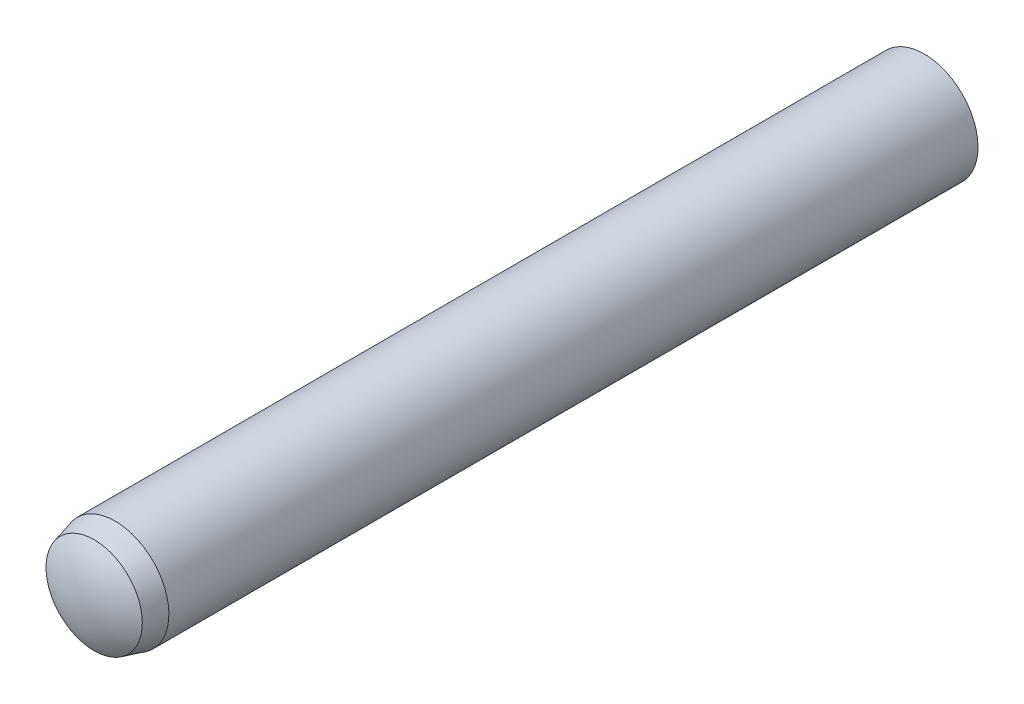
ISO-10303-21;
HEADER;
FILE_DESCRIPTION(('STEP AP214'),'2;1');
FILE_NAME('part.step','',(''),(''),'','','');
FILE_SCHEMA(('AUTOMOTIVE_DESIGN { 1 0 10303 214 1 1 1 1 }'));
ENDSEC;
DATA;
#1=APPLICATION_CONTEXT('core data for automotive mechanical design processes');
#2=APPLICATION_PROTOCOL_DEFINITION('international standard','automotive_design',2000,#1);
#3=PRODUCT_CONTEXT('',#1,'mechanical');
#4=PRODUCT('Part','Part','',(#3));
#5=PRODUCT_RELATED_PRODUCT_CATEGORY('part','',(#4));
#6=PRODUCT_DEFINITION_FORMATION('','',#4);
#7=PRODUCT_DEFINITION_CONTEXT('part definition',#1,'design');
#8=PRODUCT_DEFINITION('design','',#6,#7);
#9=PRODUCT_DEFINITION_SHAPE('','',#8);
#10=(LENGTH_UNIT() NAMED_UNIT(*) SI_UNIT(.MILLI.,.METRE.));
#11=(NAMED_UNIT(*) PLANE_ANGLE_UNIT() SI_UNIT($,.RADIAN.));
#12=(NAMED_UNIT(*) SI_UNIT($,.STERADIAN.) SOLID_ANGLE_UNIT());
#13=UNCERTAINTY_MEASURE_WITH_UNIT(LENGTH_MEASURE(1.E-05),#10,'distance_accuracy_value','');
#14=(GEOMETRIC_REPRESENTATION_CONTEXT(3) GLOBAL_UNCERTAINTY_ASSIGNED_CONTEXT((#13)) GLOBAL_UNIT_ASSIGNED_CONTEXT((#10,
#11,#12)) REPRESENTATION_CONTEXT('',''));
#15=CARTESIAN_POINT('',(0.,0.,0.));
#16=DIRECTION('',(0.,0.,1.));
#17=DIRECTION('',(1.,0.,0.));
#18=AXIS2_PLACEMENT_3D('',#15,#16,#17);
#19=CARTESIAN_POINT('',(0.,0.,-30.9166666666668));
#20=DIRECTION('',(0.,0.,1.));
#21=DIRECTION('',(0.,-1.,0.));
#22=AXIS2_PLACEMENT_3D('',#19,#20,#21);
#23=SPHERICAL_SURFACE('',#22,9.08333333333317);
#24=CARTESIAN_POINT('',(0.,0.,-38.5));
#25=DIRECTION('',(0.,0.,1.));
#26=DIRECTION('',(0.,-1.,0.));
#27=AXIS2_PLACEMENT_3D('',#24,#25,#26);
#28=CIRCLE('',#27,4.99999999999999);
#29=CARTESIAN_POINT('',(0.,-4.99999999999998,-38.5));
#30=VERTEX_POINT('',#29);
#31=EDGE_CURVE('E10',#30,#30,#28,.T.);
#32=ORIENTED_EDGE('',*,*,#31,.F.);
#33=EDGE_LOOP('',(#32));
#34=FACE_BOUND('',#33,.T.);
#35=ADVANCED_FACE('F32',(#34),#23,.T.);
#36=CARTESIAN_POINT('',(0.,0.,40.));
#37=DIRECTION('',(0.,0.,1.));
#38=DIRECTION('',(0.,-1.,0.));
#39=AXIS2_PLACEMENT_3D('',#36,#37,#38);
#40=CYLINDRICAL_SURFACE('',#39,5.);
#41=CARTESIAN_POINT('',(0.,0.,36.75));
#42=DIRECTION('',(0.,0.,1.));
#43=DIRECTION('',(0.,-1.,0.));
#44=AXIS2_PLACEMENT_3D('',#41,#42,#43);
#45=CIRCLE('',#44,5.);
#46=CARTESIAN_POINT('',(0.,-5.,36.75));
#47=VERTEX_POINT('',#46);
#48=EDGE_CURVE('E38',#47,#47,#45,.T.);
#49=ORIENTED_EDGE('',*,*,#48,.F.);
#50=EDGE_LOOP('',(#49));
#51=FACE_BOUND('',#50,.T.);
#52=ORIENTED_EDGE('',*,*,#31,.T.);
#53=EDGE_LOOP('',(#52));
#54=FACE_BOUND('',#53,.T.);
#55=ADVANCED_FACE('F53',(#51,#54),#40,.T.);
#56=CARTESIAN_POINT('',(0.,0.,36.75));
#57=DIRECTION('',(0.,0.,-1.));
#58=DIRECTION('',(0.,1.,0.));
#59=AXIS2_PLACEMENT_3D('',#56,#57,#58);
#60=CONICAL_SURFACE('',#59,5.,0.261799387799148);
#61=CARTESIAN_POINT('',(0.,0.,38.7));
#62=DIRECTION('',(0.,0.,1.));
#63=DIRECTION('',(0.,-1.,0.));
#64=AXIS2_PLACEMENT_3D('',#61,#62,#63);
#65=CIRCLE('',#64,4.47749907475931);
#66=CARTESIAN_POINT('',(0.,-4.47749907475931,38.7));
#67=VERTEX_POINT('',#66);
#68=EDGE_CURVE('E42',#67,#67,#65,.T.);
#69=ORIENTED_EDGE('',*,*,#68,.F.);
#70=EDGE_LOOP('',(#69));
#71=FACE_BOUND('',#70,.T.);
#72=ORIENTED_EDGE('',*,*,#48,.T.);
#73=EDGE_LOOP('',(#72));
#74=FACE_BOUND('',#73,.T.);
#75=ADVANCED_FACE('F51',(#71,#74),#60,.T.);
#76=CARTESIAN_POINT('',(0.,0.,31.6392315521268));
#77=DIRECTION('',(0.,0.,1.));
#78=DIRECTION('',(0.,1.,0.));
#79=AXIS2_PLACEMENT_3D('',#76,#77,#78);
#80=SPHERICAL_SURFACE('',#79,8.36076844787323);
#81=ORIENTED_EDGE('',*,*,#68,.T.);
#82=EDGE_LOOP('',(#81));
#83=FACE_BOUND('',#82,.T.);
#84=ADVANCED_FACE('F49',(#83),#80,.T.);
#85=CLOSED_SHELL('',(#35,#55,#75,#84));
#86=MANIFOLD_SOLID_BREP('B2',#85);
#87=ADVANCED_BREP_SHAPE_REPRESENTATION('',(#18,#86),#14);
#88=SHAPE_DEFINITION_REPRESENTATION(#9,#87);
ENDSEC;
END-ISO-10303-21;
